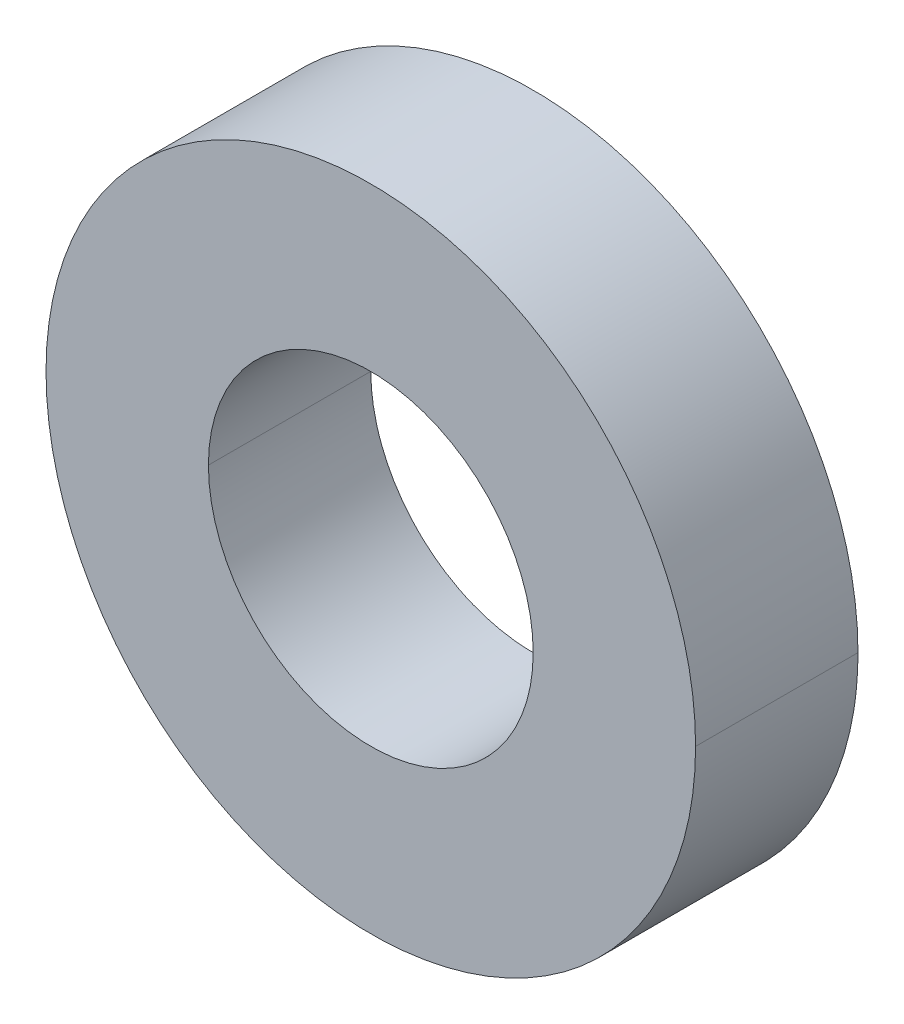
ISO-10303-21;
HEADER;
FILE_DESCRIPTION(('STEP AP214'),'2;1');
FILE_NAME('part.step','',(''),(''),'','','');
FILE_SCHEMA(('AUTOMOTIVE_DESIGN { 1 0 10303 214 1 1 1 1 }'));
ENDSEC;
DATA;
#1=APPLICATION_CONTEXT('core data for automotive mechanical design processes');
#2=APPLICATION_PROTOCOL_DEFINITION('international standard','automotive_design',2000,#1);
#3=PRODUCT_CONTEXT('',#1,'mechanical');
#4=PRODUCT('Part','Part','',(#3));
#5=PRODUCT_RELATED_PRODUCT_CATEGORY('part','',(#4));
#6=PRODUCT_DEFINITION_FORMATION('','',#4);
#7=PRODUCT_DEFINITION_CONTEXT('part definition',#1,'design');
#8=PRODUCT_DEFINITION('design','',#6,#7);
#9=PRODUCT_DEFINITION_SHAPE('','',#8);
#10=(LENGTH_UNIT() NAMED_UNIT(*) SI_UNIT(.MILLI.,.METRE.));
#11=(NAMED_UNIT(*) PLANE_ANGLE_UNIT() SI_UNIT($,.RADIAN.));
#12=(NAMED_UNIT(*) SI_UNIT($,.STERADIAN.) SOLID_ANGLE_UNIT());
#13=UNCERTAINTY_MEASURE_WITH_UNIT(LENGTH_MEASURE(1.E-05),#10,'distance_accuracy_value','');
#14=(GEOMETRIC_REPRESENTATION_CONTEXT(3) GLOBAL_UNCERTAINTY_ASSIGNED_CONTEXT((#13)) GLOBAL_UNIT_ASSIGNED_CONTEXT((#10,
#11,#12)) REPRESENTATION_CONTEXT('',''));
#15=CARTESIAN_POINT('',(0.,0.,0.));
#16=DIRECTION('',(0.,0.,1.));
#17=DIRECTION('',(1.,0.,0.));
#18=AXIS2_PLACEMENT_3D('',#15,#16,#17);
#19=CARTESIAN_POINT('',(0.,0.,0.));
#20=DIRECTION('',(0.,0.,1.));
#21=DIRECTION('',(1.,0.,0.));
#22=AXIS2_PLACEMENT_3D('',#19,#20,#21);
#23=CYLINDRICAL_SURFACE('',#22,0.5);
#24=CARTESIAN_POINT('',(-0.5,0.,-0.5));
#25=CARTESIAN_POINT('',(-0.5,-0.0991342642715459,-0.5));
#26=CARTESIAN_POINT('',(-0.461962717584204,-0.191281200092056,-0.5));
#27=CARTESIAN_POINT('',(-0.424231315680381,-0.282687127351615,-0.5));
#28=CARTESIAN_POINT('',(-0.353646376244199,-0.353460097678592,-0.5));
#29=CARTESIAN_POINT('',(-0.283820847776492,-0.423471634045758,-0.5));
#30=CARTESIAN_POINT('',(-0.191520019065653,-0.46186455655549,-0.5));
#31=CARTESIAN_POINT('',(-0.100220934915608,-0.499840799152005,-0.5));
#32=CARTESIAN_POINT('',(-0.000262466040368953,-0.499998951676136,-0.5));
#33=CARTESIAN_POINT('',(0.0986254789657065,-0.500155410436307,-0.5));
#34=CARTESIAN_POINT('',(0.19104266015554,-0.462063150236291,-0.5));
#35=CARTESIAN_POINT('',(0.28245958532738,-0.424383172817609,-0.5));
#36=CARTESIAN_POINT('',(0.353274933119382,-0.353829057227768,-0.5));
#37=CARTESIAN_POINT('',(0.423331149562337,-0.28403127261163,-0.5));
#38=CARTESIAN_POINT('',(0.461765538258634,-0.191761787676937,-0.5));
#39=CARTESIAN_POINT('',(0.5,-0.0999722676325892,-0.5));
#40=CARTESIAN_POINT('',(0.5,0.,-0.5));
#41=B_SPLINE_CURVE_WITH_KNOTS('',2,(#24,#25,#26,#27,#28,#29,#30,#31,#32,#33,#34,#35,#36,#37,#38,
#39,#40),.UNSPECIFIED.,.F.,.F.,(3,2,2,2,2,2,2,2,3),(0.,0.125,0.25,0.375,0.5,0.625,0.75,0.875,
1.),.UNSPECIFIED.);
#42=CARTESIAN_POINT('',(-0.5,0.,-0.5));
#43=VERTEX_POINT('',#42);
#44=CARTESIAN_POINT('',(0.5,0.,-0.5));
#45=VERTEX_POINT('',#44);
#46=EDGE_CURVE('E78',#43,#45,#41,.T.);
#47=ORIENTED_EDGE('',*,*,#46,.F.);
#48=DIRECTION('',(0.,0.,1.));
#49=VECTOR('',#48,1.);
#50=CARTESIAN_POINT('',(-0.5,0.,0.));
#51=LINE('',#50,#49);
#52=CARTESIAN_POINT('',(-0.5,0.,0.));
#53=VERTEX_POINT('',#52);
#54=EDGE_CURVE('E30',#43,#53,#51,.T.);
#55=ORIENTED_EDGE('',*,*,#54,.T.);
#56=CARTESIAN_POINT('',(0.,0.,0.));
#57=DIRECTION('',(0.,0.,1.));
#58=DIRECTION('',(1.,0.,0.));
#59=AXIS2_PLACEMENT_3D('',#56,#57,#58);
#60=CIRCLE('',#59,0.5);
#61=CARTESIAN_POINT('',(0.5,0.,0.));
#62=VERTEX_POINT('',#61);
#63=EDGE_CURVE('E75',#53,#62,#60,.T.);
#64=ORIENTED_EDGE('',*,*,#63,.T.);
#65=DIRECTION('',(0.,0.,1.));
#66=VECTOR('',#65,1.);
#67=CARTESIAN_POINT('',(0.5,0.,0.));
#68=LINE('',#67,#66);
#69=EDGE_CURVE('E11',#45,#62,#68,.T.);
#70=ORIENTED_EDGE('',*,*,#69,.F.);
#71=EDGE_LOOP('',(#47,#55,#64,#70));
#72=FACE_BOUND('',#71,.T.);
#73=ADVANCED_FACE('F17',(#72),#23,.F.);
#74=CARTESIAN_POINT('',(0.,0.,0.));
#75=DIRECTION('',(0.,0.,1.));
#76=DIRECTION('',(1.,0.,0.));
#77=AXIS2_PLACEMENT_3D('',#74,#75,#76);
#78=CYLINDRICAL_SURFACE('',#77,0.5);
#79=ORIENTED_EDGE('',*,*,#54,.F.);
#80=CARTESIAN_POINT('',(0.5,0.,-0.5));
#81=CARTESIAN_POINT('',(0.5,0.0991342642717502,-0.5));
#82=CARTESIAN_POINT('',(0.461962717584079,0.191281200092407,-0.5));
#83=CARTESIAN_POINT('',(0.42423131568007,0.282687127352256,-0.5));
#84=CARTESIAN_POINT('',(0.353646376244171,0.353460097679021,-0.5));
#85=CARTESIAN_POINT('',(0.283820847777038,0.423471634045684,-0.5));
#86=CARTESIAN_POINT('',(0.19152001906467,0.461864556555746,-0.5));
#87=CARTESIAN_POINT('',(0.100220934914333,0.499840799152078,-0.5));
#88=CARTESIAN_POINT('',(0.000262466039905999,0.49999895167613,-0.5));
#89=CARTESIAN_POINT('',(-0.098625478965935,0.500155410436223,-0.5));
#90=CARTESIAN_POINT('',(-0.191042660155722,0.462063150236209,-0.5));
#91=CARTESIAN_POINT('',(-0.282459585327501,0.424383172817536,-0.5));
#92=CARTESIAN_POINT('',(-0.353274933119664,0.353829057227697,-0.5));
#93=CARTESIAN_POINT('',(-0.423331149562609,0.284031272611729,-0.5));
#94=CARTESIAN_POINT('',(-0.461765538258797,0.191761787676459,-0.5));
#95=CARTESIAN_POINT('',(-0.5,0.0999722676316688,-0.5));
#96=CARTESIAN_POINT('',(-0.5,0.,-0.5));
#97=B_SPLINE_CURVE_WITH_KNOTS('',2,(#80,#81,#82,#83,#84,#85,#86,#87,#88,#89,#90,#91,#92,#93,#94,
#95,#96),.UNSPECIFIED.,.F.,.F.,(3,2,2,2,2,2,2,2,3),(0.,0.125,0.25,0.375,0.5,0.625,0.75,0.875,
1.),.UNSPECIFIED.);
#98=EDGE_CURVE('E71',#45,#43,#97,.T.);
#99=ORIENTED_EDGE('',*,*,#98,.F.);
#100=ORIENTED_EDGE('',*,*,#69,.T.);
#101=CARTESIAN_POINT('',(0.,0.,0.));
#102=DIRECTION('',(0.,0.,1.));
#103=DIRECTION('',(1.,0.,0.));
#104=AXIS2_PLACEMENT_3D('',#101,#102,#103);
#105=CIRCLE('',#104,0.5);
#106=EDGE_CURVE('E73',#62,#53,#105,.T.);
#107=ORIENTED_EDGE('',*,*,#106,.T.);
#108=EDGE_LOOP('',(#79,#99,#100,#107));
#109=FACE_BOUND('',#108,.T.);
#110=ADVANCED_FACE('F69',(#109),#78,.F.);
#111=CARTESIAN_POINT('',(0.5,0.,0.));
#112=DIRECTION('',(0.,0.,1.));
#113=DIRECTION('',(1.,0.,0.));
#114=AXIS2_PLACEMENT_3D('',#111,#112,#113);
#115=PLANE('',#114);
#116=ORIENTED_EDGE('',*,*,#106,.F.);
#117=ORIENTED_EDGE('',*,*,#63,.F.);
#118=EDGE_LOOP('',(#116,#117));
#119=FACE_BOUND('',#118,.T.);
#120=CARTESIAN_POINT('',(0.,0.,0.));
#121=DIRECTION('',(0.,0.,1.));
#122=DIRECTION('',(1.,0.,0.));
#123=AXIS2_PLACEMENT_3D('',#120,#121,#122);
#124=CIRCLE('',#123,1.);
#125=CARTESIAN_POINT('',(1.,0.,0.));
#126=VERTEX_POINT('',#125);
#127=CARTESIAN_POINT('',(-1.,0.,0.));
#128=VERTEX_POINT('',#127);
#129=EDGE_CURVE('E130',#126,#128,#124,.T.);
#130=ORIENTED_EDGE('',*,*,#129,.T.);
#131=CARTESIAN_POINT('',(0.,0.,0.));
#132=DIRECTION('',(0.,0.,1.));
#133=DIRECTION('',(1.,0.,0.));
#134=AXIS2_PLACEMENT_3D('',#131,#132,#133);
#135=CIRCLE('',#134,1.);
#136=EDGE_CURVE('E83',#128,#126,#135,.T.);
#137=ORIENTED_EDGE('',*,*,#136,.T.);
#138=EDGE_LOOP('',(#130,#137));
#139=FACE_BOUND('',#138,.T.);
#140=ADVANCED_FACE('F19',(#119,#139),#115,.T.);
#141=CARTESIAN_POINT('',(0.,0.,0.));
#142=DIRECTION('',(0.,0.,1.));
#143=DIRECTION('',(1.,0.,0.));
#144=AXIS2_PLACEMENT_3D('',#141,#142,#143);
#145=CYLINDRICAL_SURFACE('',#144,1.);
#146=DIRECTION('',(0.,0.,1.));
#147=VECTOR('',#146,1.);
#148=CARTESIAN_POINT('',(-1.,0.,0.));
#149=LINE('',#148,#147);
#150=CARTESIAN_POINT('',(-1.,0.,-0.5));
#151=VERTEX_POINT('',#150);
#152=EDGE_CURVE('E125',#151,#128,#149,.T.);
#153=ORIENTED_EDGE('',*,*,#152,.F.);
#154=CARTESIAN_POINT('',(-1.,0.,-0.5));
#155=CARTESIAN_POINT('',(-1.,-0.0979785568148,-0.5));
#156=CARTESIAN_POINT('',(-0.988000253016,-0.195956689375,-0.5));
#157=CARTESIAN_POINT('',(-0.963997580109,-0.29198034652,-0.5));
#158=CARTESIAN_POINT('',(-0.892969030651,-0.476182526371,-0.5));
#159=CARTESIAN_POINT('',(-0.779587891188,-0.637797965008,-0.5));
#160=CARTESIAN_POINT('',(-0.713225814277,-0.711233291885,-0.5));
#161=CARTESIAN_POINT('',(-0.563877854178,-0.840348293241,-0.5));
#162=CARTESIAN_POINT('',(-0.387786650424,-0.929604775489,-0.5));
#163=CARTESIAN_POINT('',(-0.294676065443,-0.963176969096,-0.5));
#164=CARTESIAN_POINT('',(-0.10214104395,-1.00683200961,-0.5));
#165=CARTESIAN_POINT('',(0.0952368426435,-1.00273299981,-0.5));
#166=CARTESIAN_POINT('',(0.193192755745,-0.98854459464,-0.5));
#167=CARTESIAN_POINT('',(0.38362324251,-0.936470338779,-0.5));
#168=CARTESIAN_POINT('',(0.555856987943,-0.839980078754,-0.5));
#169=CARTESIAN_POINT('',(0.635615255515,-0.78136873771,-0.5));
#170=CARTESIAN_POINT('',(0.779144673579,-0.645815039949,-0.5));
#171=CARTESIAN_POINT('',(0.885718312666,-0.479631727957,-0.5));
#172=CARTESIAN_POINT('',(0.928516747925,-0.390385074428,-0.5));
#173=CARTESIAN_POINT('',(0.972911898439,-0.25822255235,-0.5));
#174=CARTESIAN_POINT('',(0.993856533221,-0.121253382943,-0.5));
#175=CARTESIAN_POINT('',(0.997959135699,-0.0808132256003,-0.5));
#176=CARTESIAN_POINT('',(1.,-0.0404065767224,-0.5));
#177=CARTESIAN_POINT('',(1.,0.,-0.5));
#178=(BOUNDED_CURVE() B_SPLINE_CURVE(5,(#154,#155,#156,#157,#158,#159,#160,#161,#162,#163,#164,
#165,#166,#167,#168,#169,#170,#171,#172,#173,#174,#175,#176,#177),.UNSPECIFIED.,.F.,
.F.) B_SPLINE_CURVE_WITH_KNOTS((6,3,3,3,3,3,3,6),(0.,0.692813019347,1.3856260256,2.07843902508,
2.77125203691,3.46406506002,4.15687807886,4.44259572291),
.UNSPECIFIED.) CURVE() GEOMETRIC_REPRESENTATION_ITEM() RATIONAL_B_SPLINE_CURVE((1.,1.,1.,1.,1.,
1.,1.,1.,1.,1.,1.,1.,1.,1.,1.,1.,1.,1.,1.,1.,1.,1.,1.,1.)) REPRESENTATION_ITEM(''));
#179=CARTESIAN_POINT('',(1.,0.,-0.5));
#180=VERTEX_POINT('',#179);
#181=EDGE_CURVE('E90',#151,#180,#178,.T.);
#182=ORIENTED_EDGE('',*,*,#181,.T.);
#183=DIRECTION('',(0.,0.,1.));
#184=VECTOR('',#183,1.);
#185=CARTESIAN_POINT('',(1.,0.,0.));
#186=LINE('',#185,#184);
#187=EDGE_CURVE('E126',#180,#126,#186,.T.);
#188=ORIENTED_EDGE('',*,*,#187,.T.);
#189=ORIENTED_EDGE('',*,*,#136,.F.);
#190=EDGE_LOOP('',(#153,#182,#188,#189));
#191=FACE_BOUND('',#190,.T.);
#192=ADVANCED_FACE('F106',(#191),#145,.T.);
#193=CARTESIAN_POINT('',(0.5,0.,-0.5));
#194=DIRECTION('',(0.,0.,-1.));
#195=DIRECTION('',(0.,-1.,0.));
#196=AXIS2_PLACEMENT_3D('',#193,#194,#195);
#197=PLANE('',#196);
#198=ORIENTED_EDGE('',*,*,#98,.T.);
#199=ORIENTED_EDGE('',*,*,#46,.T.);
#200=EDGE_LOOP('',(#198,#199));
#201=FACE_BOUND('',#200,.T.);
#202=CARTESIAN_POINT('',(0.,0.,-0.5));
#203=DIRECTION('',(0.,0.,1.));
#204=DIRECTION('',(1.,0.,0.));
#205=AXIS2_PLACEMENT_3D('',#202,#203,#204);
#206=CIRCLE('',#205,1.);
#207=EDGE_CURVE('E121',#180,#151,#206,.T.);
#208=ORIENTED_EDGE('',*,*,#207,.F.);
#209=ORIENTED_EDGE('',*,*,#181,.F.);
#210=EDGE_LOOP('',(#208,#209));
#211=FACE_BOUND('',#210,.T.);
#212=ADVANCED_FACE('F87',(#201,#211),#197,.T.);
#213=CARTESIAN_POINT('',(0.,0.,0.));
#214=DIRECTION('',(0.,0.,1.));
#215=DIRECTION('',(1.,0.,0.));
#216=AXIS2_PLACEMENT_3D('',#213,#214,#215);
#217=CYLINDRICAL_SURFACE('',#216,1.);
#218=ORIENTED_EDGE('',*,*,#207,.T.);
#219=ORIENTED_EDGE('',*,*,#152,.T.);
#220=ORIENTED_EDGE('',*,*,#129,.F.);
#221=ORIENTED_EDGE('',*,*,#187,.F.);
#222=EDGE_LOOP('',(#218,#219,#220,#221));
#223=FACE_BOUND('',#222,.T.);
#224=ADVANCED_FACE('F105',(#223),#217,.T.);
#225=CLOSED_SHELL('',(#73,#110,#140,#192,#212,#224));
#226=MANIFOLD_SOLID_BREP('B1',#225);
#227=ADVANCED_BREP_SHAPE_REPRESENTATION('',(#18,#226),#14);
#228=SHAPE_DEFINITION_REPRESENTATION(#9,#227);
ENDSEC;
END-ISO-10303-21;
